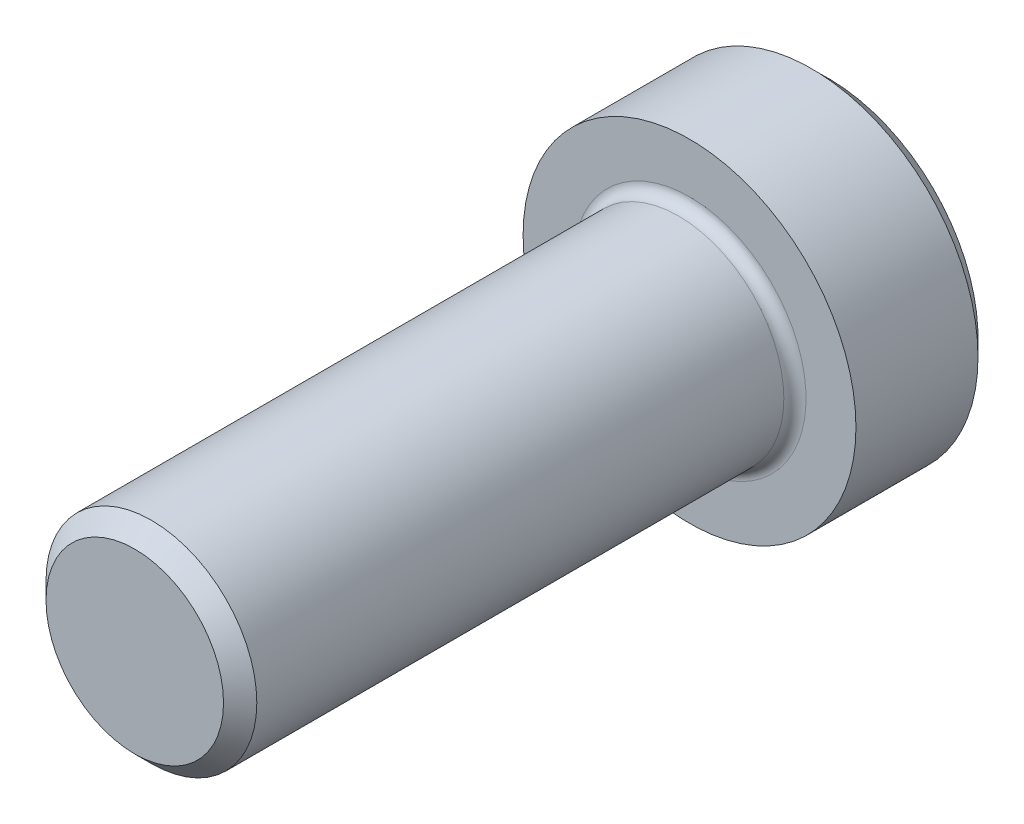
ISO-10303-21;
HEADER;
FILE_DESCRIPTION(('STEP AP214'),'2;1');
FILE_NAME('part.step','',(''),(''),'','','');
FILE_SCHEMA(('AUTOMOTIVE_DESIGN { 1 0 10303 214 1 1 1 1 }'));
ENDSEC;
DATA;
#1=APPLICATION_CONTEXT('core data for automotive mechanical design processes');
#2=APPLICATION_PROTOCOL_DEFINITION('international standard','automotive_design',2000,#1);
#3=PRODUCT_CONTEXT('',#1,'mechanical');
#4=PRODUCT('Part','Part','',(#3));
#5=PRODUCT_RELATED_PRODUCT_CATEGORY('part','',(#4));
#6=PRODUCT_DEFINITION_FORMATION('','',#4);
#7=PRODUCT_DEFINITION_CONTEXT('part definition',#1,'design');
#8=PRODUCT_DEFINITION('design','',#6,#7);
#9=PRODUCT_DEFINITION_SHAPE('','',#8);
#10=(LENGTH_UNIT() NAMED_UNIT(*) SI_UNIT(.MILLI.,.METRE.));
#11=(NAMED_UNIT(*) PLANE_ANGLE_UNIT() SI_UNIT($,.RADIAN.));
#12=(NAMED_UNIT(*) SI_UNIT($,.STERADIAN.) SOLID_ANGLE_UNIT());
#13=UNCERTAINTY_MEASURE_WITH_UNIT(LENGTH_MEASURE(1.E-05),#10,'distance_accuracy_value','');
#14=(GEOMETRIC_REPRESENTATION_CONTEXT(3) GLOBAL_UNCERTAINTY_ASSIGNED_CONTEXT((#13)) GLOBAL_UNIT_ASSIGNED_CONTEXT((#10,
#11,#12)) REPRESENTATION_CONTEXT('',''));
#15=CARTESIAN_POINT('',(0.,0.,0.));
#16=DIRECTION('',(0.,0.,1.));
#17=DIRECTION('',(1.,0.,0.));
#18=AXIS2_PLACEMENT_3D('',#15,#16,#17);
#19=CARTESIAN_POINT('',(0.,0.,-0.1));
#20=DIRECTION('',(0.,0.,-1.));
#21=DIRECTION('',(-1.,0.,0.));
#22=AXIS2_PLACEMENT_3D('',#19,#20,#21);
#23=PLANE('',#22);
#24=CARTESIAN_POINT('',(0.,0.,-0.1));
#25=DIRECTION('',(0.,0.,-1.));
#26=DIRECTION('',(-1.,0.,0.));
#27=AXIS2_PLACEMENT_3D('',#24,#25,#26);
#28=CIRCLE('',#27,0.175);
#29=CARTESIAN_POINT('',(-0.151554445662277,0.0875000000000001,-0.1));
#30=VERTEX_POINT('',#29);
#31=CARTESIAN_POINT('',(0.,0.175,-0.1));
#32=VERTEX_POINT('',#31);
#33=EDGE_CURVE('E57',#30,#32,#28,.T.);
#34=ORIENTED_EDGE('',*,*,#33,.F.);
#35=DIRECTION('',(0.5,0.866025403784439,0.));
#36=VECTOR('',#35,1.);
#37=CARTESIAN_POINT('',(-0.202072594216369,0.,-0.1));
#38=LINE('',#37,#36);
#39=CARTESIAN_POINT('',(-0.101036297108184,0.175,-0.1));
#40=VERTEX_POINT('',#39);
#41=EDGE_CURVE('E128',#30,#40,#38,.T.);
#42=ORIENTED_EDGE('',*,*,#41,.T.);
#43=DIRECTION('',(1.,0.,0.));
#44=VECTOR('',#43,1.);
#45=CARTESIAN_POINT('',(-0.101036297108184,0.175,-0.1));
#46=LINE('',#45,#44);
#47=EDGE_CURVE('E131',#40,#32,#46,.T.);
#48=ORIENTED_EDGE('',*,*,#47,.T.);
#49=EDGE_LOOP('',(#34,#42,#48));
#50=FACE_BOUND('',#49,.T.);
#51=ADVANCED_FACE('F45',(#50),#23,.T.);
#52=CARTESIAN_POINT('',(0.151554445662277,0.0875000000000001,-0.1));
#53=VERTEX_POINT('',#52);
#54=EDGE_CURVE('E11',#32,#53,#28,.T.);
#55=ORIENTED_EDGE('',*,*,#54,.F.);
#56=CARTESIAN_POINT('',(0.101036297108185,0.175,-0.1));
#57=VERTEX_POINT('',#56);
#58=EDGE_CURVE('E146',#32,#57,#46,.T.);
#59=ORIENTED_EDGE('',*,*,#58,.T.);
#60=DIRECTION('',(0.5,-0.866025403784439,0.));
#61=VECTOR('',#60,1.);
#62=CARTESIAN_POINT('',(0.101036297108185,0.175,-0.1));
#63=LINE('',#62,#61);
#64=EDGE_CURVE('E154',#57,#53,#63,.T.);
#65=ORIENTED_EDGE('',*,*,#64,.T.);
#66=EDGE_LOOP('',(#55,#59,#65));
#67=FACE_BOUND('',#66,.T.);
#68=ADVANCED_FACE('F250',(#67),#23,.T.);
#69=CARTESIAN_POINT('',(0.151554445662277,-0.0875000000000001,-0.1));
#70=VERTEX_POINT('',#69);
#71=EDGE_CURVE('E55',#53,#70,#28,.T.);
#72=ORIENTED_EDGE('',*,*,#71,.F.);
#73=CARTESIAN_POINT('',(0.202072594216369,0.,-0.1));
#74=VERTEX_POINT('',#73);
#75=EDGE_CURVE('E153',#53,#74,#63,.T.);
#76=ORIENTED_EDGE('',*,*,#75,.T.);
#77=DIRECTION('',(-0.5,-0.866025403784439,0.));
#78=VECTOR('',#77,1.);
#79=CARTESIAN_POINT('',(0.202072594216369,0.,-0.1));
#80=LINE('',#79,#78);
#81=EDGE_CURVE('E159',#74,#70,#80,.T.);
#82=ORIENTED_EDGE('',*,*,#81,.T.);
#83=EDGE_LOOP('',(#72,#76,#82));
#84=FACE_BOUND('',#83,.T.);
#85=ADVANCED_FACE('F255',(#84),#23,.T.);
#86=CARTESIAN_POINT('',(0.,-0.175,-0.1));
#87=VERTEX_POINT('',#86);
#88=EDGE_CURVE('E285',#70,#87,#28,.T.);
#89=ORIENTED_EDGE('',*,*,#88,.F.);
#90=CARTESIAN_POINT('',(0.101036297108185,-0.175,-0.1));
#91=VERTEX_POINT('',#90);
#92=EDGE_CURVE('E158',#70,#91,#80,.T.);
#93=ORIENTED_EDGE('',*,*,#92,.T.);
#94=DIRECTION('',(-1.,0.,0.));
#95=VECTOR('',#94,1.);
#96=CARTESIAN_POINT('',(0.101036297108185,-0.175,-0.1));
#97=LINE('',#96,#95);
#98=EDGE_CURVE('E164',#91,#87,#97,.T.);
#99=ORIENTED_EDGE('',*,*,#98,.T.);
#100=EDGE_LOOP('',(#89,#93,#99));
#101=FACE_BOUND('',#100,.T.);
#102=ADVANCED_FACE('F271',(#101),#23,.T.);
#103=CARTESIAN_POINT('',(-0.151554445662277,-0.0875,-0.1));
#104=VERTEX_POINT('',#103);
#105=EDGE_CURVE('E64',#87,#104,#28,.T.);
#106=ORIENTED_EDGE('',*,*,#105,.F.);
#107=CARTESIAN_POINT('',(-0.101036297108185,-0.175,-0.1));
#108=VERTEX_POINT('',#107);
#109=EDGE_CURVE('E163',#87,#108,#97,.T.);
#110=ORIENTED_EDGE('',*,*,#109,.T.);
#111=DIRECTION('',(-0.5,0.866025403784439,0.));
#112=VECTOR('',#111,1.);
#113=CARTESIAN_POINT('',(-0.101036297108185,-0.175,-0.1));
#114=LINE('',#113,#112);
#115=EDGE_CURVE('E141',#108,#104,#114,.T.);
#116=ORIENTED_EDGE('',*,*,#115,.T.);
#117=EDGE_LOOP('',(#106,#110,#116));
#118=FACE_BOUND('',#117,.T.);
#119=ADVANCED_FACE('F260',(#118),#23,.T.);
#120=CARTESIAN_POINT('',(0.,0.,1.));
#121=DIRECTION('',(0.,0.,-1.));
#122=DIRECTION('',(-1.,0.,0.));
#123=AXIS2_PLACEMENT_3D('',#120,#121,#122);
#124=CYLINDRICAL_SURFACE('',#123,0.19);
#125=CARTESIAN_POINT('',(0.,0.,0.0200000000000001));
#126=DIRECTION('',(0.,0.,-1.));
#127=DIRECTION('',(-1.,0.,0.));
#128=AXIS2_PLACEMENT_3D('',#125,#126,#127);
#129=CIRCLE('',#128,0.19);
#130=CARTESIAN_POINT('',(-0.19,0.,0.0200000000000001));
#131=VERTEX_POINT('',#130);
#132=EDGE_CURVE('E225',#131,#131,#129,.F.);
#133=ORIENTED_EDGE('',*,*,#132,.T.);
#134=EDGE_LOOP('',(#133));
#135=FACE_BOUND('',#134,.T.);
#136=CARTESIAN_POINT('',(0.,0.,0.97));
#137=DIRECTION('',(0.,0.,1.));
#138=DIRECTION('',(1.,0.,0.));
#139=AXIS2_PLACEMENT_3D('',#136,#137,#138);
#140=CIRCLE('',#139,0.19);
#141=CARTESIAN_POINT('',(0.19,0.,0.97));
#142=VERTEX_POINT('',#141);
#143=EDGE_CURVE('E222',#142,#142,#140,.F.);
#144=ORIENTED_EDGE('',*,*,#143,.T.);
#145=EDGE_LOOP('',(#144));
#146=FACE_BOUND('',#145,.T.);
#147=ADVANCED_FACE('F270',(#135,#146),#124,.T.);
#148=CARTESIAN_POINT('',(0.,0.,1.));
#149=DIRECTION('',(0.,0.,1.));
#150=DIRECTION('',(1.,0.,0.));
#151=AXIS2_PLACEMENT_3D('',#148,#149,#150);
#152=PLANE('',#151);
#153=CARTESIAN_POINT('',(0.,0.,1.));
#154=DIRECTION('',(0.,0.,1.));
#155=DIRECTION('',(1.,0.,0.));
#156=AXIS2_PLACEMENT_3D('',#153,#154,#155);
#157=CIRCLE('',#156,0.16);
#158=CARTESIAN_POINT('',(0.16,0.,1.));
#159=VERTEX_POINT('',#158);
#160=EDGE_CURVE('E218',#159,#159,#157,.T.);
#161=ORIENTED_EDGE('',*,*,#160,.T.);
#162=EDGE_LOOP('',(#161));
#163=FACE_BOUND('',#162,.T.);
#164=ADVANCED_FACE('F277',(#163),#152,.T.);
#165=CARTESIAN_POINT('',(0.,0.,-0.25));
#166=DIRECTION('',(0.,0.,1.));
#167=DIRECTION('',(1.,0.,0.));
#168=AXIS2_PLACEMENT_3D('',#165,#166,#167);
#169=CYLINDRICAL_SURFACE('',#168,0.3);
#170=CARTESIAN_POINT('',(0.,0.,-0.22));
#171=DIRECTION('',(0.,0.,-1.));
#172=DIRECTION('',(-1.,0.,0.));
#173=AXIS2_PLACEMENT_3D('',#170,#171,#172);
#174=CIRCLE('',#173,0.3);
#175=CARTESIAN_POINT('',(-0.3,0.,-0.22));
#176=VERTEX_POINT('',#175);
#177=EDGE_CURVE('E214',#176,#176,#174,.F.);
#178=ORIENTED_EDGE('',*,*,#177,.T.);
#179=EDGE_LOOP('',(#178));
#180=FACE_BOUND('',#179,.T.);
#181=CARTESIAN_POINT('',(0.,0.,0.));
#182=DIRECTION('',(0.,0.,-1.));
#183=DIRECTION('',(-1.,0.,0.));
#184=AXIS2_PLACEMENT_3D('',#181,#182,#183);
#185=CIRCLE('',#184,0.3);
#186=CARTESIAN_POINT('',(-0.3,0.,0.));
#187=VERTEX_POINT('',#186);
#188=EDGE_CURVE('E193',#187,#187,#185,.T.);
#189=ORIENTED_EDGE('',*,*,#188,.T.);
#190=EDGE_LOOP('',(#189));
#191=FACE_BOUND('',#190,.T.);
#192=ADVANCED_FACE('F415',(#180,#191),#169,.T.);
#193=CARTESIAN_POINT('',(0.,0.,-0.25));
#194=DIRECTION('',(0.,0.,-1.));
#195=DIRECTION('',(-1.,0.,0.));
#196=AXIS2_PLACEMENT_3D('',#193,#194,#195);
#197=PLANE('',#196);
#198=DIRECTION('',(-0.5,0.866025403784439,0.));
#199=VECTOR('',#198,1.);
#200=CARTESIAN_POINT('',(-0.101036297108185,-0.175,-0.25));
#201=LINE('',#200,#199);
#202=CARTESIAN_POINT('',(-0.101036297108185,-0.175,-0.25));
#203=VERTEX_POINT('',#202);
#204=CARTESIAN_POINT('',(-0.202072594216369,0.,-0.25));
#205=VERTEX_POINT('',#204);
#206=EDGE_CURVE('E72',#203,#205,#201,.T.);
#207=ORIENTED_EDGE('',*,*,#206,.F.);
#208=DIRECTION('',(-1.,0.,0.));
#209=VECTOR('',#208,1.);
#210=CARTESIAN_POINT('',(0.101036297108185,-0.175,-0.25));
#211=LINE('',#210,#209);
#212=CARTESIAN_POINT('',(0.101036297108185,-0.175,-0.25));
#213=VERTEX_POINT('',#212);
#214=EDGE_CURVE('E186',#213,#203,#211,.T.);
#215=ORIENTED_EDGE('',*,*,#214,.F.);
#216=DIRECTION('',(-0.5,-0.866025403784439,0.));
#217=VECTOR('',#216,1.);
#218=CARTESIAN_POINT('',(0.202072594216369,0.,-0.25));
#219=LINE('',#218,#217);
#220=CARTESIAN_POINT('',(0.202072594216369,0.,-0.25));
#221=VERTEX_POINT('',#220);
#222=EDGE_CURVE('E182',#221,#213,#219,.T.);
#223=ORIENTED_EDGE('',*,*,#222,.F.);
#224=DIRECTION('',(0.5,-0.866025403784439,0.));
#225=VECTOR('',#224,1.);
#226=CARTESIAN_POINT('',(0.101036297108185,0.175,-0.25));
#227=LINE('',#226,#225);
#228=CARTESIAN_POINT('',(0.101036297108185,0.175,-0.25));
#229=VERTEX_POINT('',#228);
#230=EDGE_CURVE('E178',#229,#221,#227,.T.);
#231=ORIENTED_EDGE('',*,*,#230,.F.);
#232=DIRECTION('',(1.,0.,0.));
#233=VECTOR('',#232,1.);
#234=CARTESIAN_POINT('',(-0.101036297108184,0.175,-0.25));
#235=LINE('',#234,#233);
#236=CARTESIAN_POINT('',(-0.101036297108184,0.175,-0.25));
#237=VERTEX_POINT('',#236);
#238=EDGE_CURVE('E174',#237,#229,#235,.T.);
#239=ORIENTED_EDGE('',*,*,#238,.F.);
#240=DIRECTION('',(0.5,0.866025403784439,0.));
#241=VECTOR('',#240,1.);
#242=CARTESIAN_POINT('',(-0.202072594216369,0.,-0.25));
#243=LINE('',#242,#241);
#244=EDGE_CURVE('E171',#205,#237,#243,.T.);
#245=ORIENTED_EDGE('',*,*,#244,.F.);
#246=EDGE_LOOP('',(#207,#215,#223,#231,#239,#245));
#247=FACE_BOUND('',#246,.T.);
#248=CARTESIAN_POINT('',(0.,0.,-0.25));
#249=DIRECTION('',(0.,0.,-1.));
#250=DIRECTION('',(-1.,0.,0.));
#251=AXIS2_PLACEMENT_3D('',#248,#249,#250);
#252=CIRCLE('',#251,0.27);
#253=CARTESIAN_POINT('',(-0.27,0.,-0.25));
#254=VERTEX_POINT('',#253);
#255=EDGE_CURVE('E210',#254,#254,#252,.T.);
#256=ORIENTED_EDGE('',*,*,#255,.T.);
#257=EDGE_LOOP('',(#256));
#258=FACE_BOUND('',#257,.T.);
#259=ADVANCED_FACE('F300',(#247,#258),#197,.T.);
#260=CARTESIAN_POINT('',(0.,0.,0.));
#261=DIRECTION('',(0.,0.,-1.));
#262=DIRECTION('',(-1.,0.,0.));
#263=AXIS2_PLACEMENT_3D('',#260,#261,#262);
#264=PLANE('',#263);
#265=CARTESIAN_POINT('',(0.,0.,0.));
#266=DIRECTION('',(0.,0.,-1.));
#267=DIRECTION('',(-1.,0.,0.));
#268=AXIS2_PLACEMENT_3D('',#265,#266,#267);
#269=CIRCLE('',#268,0.21);
#270=CARTESIAN_POINT('',(-0.21,0.,0.));
#271=VERTEX_POINT('',#270);
#272=EDGE_CURVE('E49',#271,#271,#269,.T.);
#273=ORIENTED_EDGE('',*,*,#272,.T.);
#274=EDGE_LOOP('',(#273));
#275=FACE_BOUND('',#274,.T.);
#276=ORIENTED_EDGE('',*,*,#188,.F.);
#277=EDGE_LOOP('',(#276));
#278=FACE_BOUND('',#277,.T.);
#279=ADVANCED_FACE('F234',(#275,#278),#264,.F.);
#280=CARTESIAN_POINT('',(0.,0.,-0.25));
#281=DIRECTION('',(0.,0.,1.));
#282=DIRECTION('',(1.,0.,0.));
#283=AXIS2_PLACEMENT_3D('',#280,#281,#282);
#284=CONICAL_SURFACE('',#283,0.27,0.785398163397447);
#285=ORIENTED_EDGE('',*,*,#177,.F.);
#286=EDGE_LOOP('',(#285));
#287=FACE_BOUND('',#286,.T.);
#288=ORIENTED_EDGE('',*,*,#255,.F.);
#289=EDGE_LOOP('',(#288));
#290=FACE_BOUND('',#289,.T.);
#291=ADVANCED_FACE('F247',(#287,#290),#284,.T.);
#292=CARTESIAN_POINT('',(0.,0.,1.));
#293=DIRECTION('',(0.,0.,-1.));
#294=DIRECTION('',(-1.,0.,0.));
#295=AXIS2_PLACEMENT_3D('',#292,#293,#294);
#296=CONICAL_SURFACE('',#295,0.16,0.785398163397448);
#297=ORIENTED_EDGE('',*,*,#143,.F.);
#298=EDGE_LOOP('',(#297));
#299=FACE_BOUND('',#298,.T.);
#300=ORIENTED_EDGE('',*,*,#160,.F.);
#301=EDGE_LOOP('',(#300));
#302=FACE_BOUND('',#301,.T.);
#303=ADVANCED_FACE('F240',(#299,#302),#296,.T.);
#304=CARTESIAN_POINT('',(0.,0.,0.0200000000000001));
#305=DIRECTION('',(0.,0.,-1.));
#306=DIRECTION('',(-1.,0.,0.));
#307=AXIS2_PLACEMENT_3D('',#304,#305,#306);
#308=TOROIDAL_SURFACE('',#307,0.21,0.02);
#309=ORIENTED_EDGE('',*,*,#272,.F.);
#310=EDGE_LOOP('',(#309));
#311=FACE_BOUND('',#310,.T.);
#312=ORIENTED_EDGE('',*,*,#132,.F.);
#313=EDGE_LOOP('',(#312));
#314=FACE_BOUND('',#313,.T.);
#315=ADVANCED_FACE('F47',(#311,#314),#308,.F.);
#316=CARTESIAN_POINT('',(-0.101036297108185,-0.175,-0.1));
#317=DIRECTION('',(-0.866025403784439,-0.5,0.));
#318=DIRECTION('',(0.5,-0.866025403784439,0.));
#319=AXIS2_PLACEMENT_3D('',#316,#317,#318);
#320=PLANE('',#319);
#321=ORIENTED_EDGE('',*,*,#206,.T.);
#322=DIRECTION('',(0.,0.,-1.));
#323=VECTOR('',#322,1.);
#324=CARTESIAN_POINT('',(-0.202072594216369,0.,-0.1));
#325=LINE('',#324,#323);
#326=CARTESIAN_POINT('',(-0.202072594216369,0.,-0.1));
#327=VERTEX_POINT('',#326);
#328=EDGE_CURVE('E168',#327,#205,#325,.T.);
#329=ORIENTED_EDGE('',*,*,#328,.F.);
#330=EDGE_CURVE('E144',#104,#327,#114,.T.);
#331=ORIENTED_EDGE('',*,*,#330,.F.);
#332=ORIENTED_EDGE('',*,*,#115,.F.);
#333=DIRECTION('',(0.,0.,-1.));
#334=VECTOR('',#333,1.);
#335=CARTESIAN_POINT('',(-0.101036297108185,-0.175,-0.1));
#336=LINE('',#335,#334);
#337=EDGE_CURVE('E190',#108,#203,#336,.T.);
#338=ORIENTED_EDGE('',*,*,#337,.T.);
#339=EDGE_LOOP('',(#321,#329,#331,#332,#338));
#340=FACE_BOUND('',#339,.T.);
#341=ADVANCED_FACE('F239',(#340),#320,.F.);
#342=CARTESIAN_POINT('',(0.101036297108185,-0.175,-0.1));
#343=DIRECTION('',(0.,-1.,0.));
#344=DIRECTION('',(1.,0.,0.));
#345=AXIS2_PLACEMENT_3D('',#342,#343,#344);
#346=PLANE('',#345);
#347=ORIENTED_EDGE('',*,*,#214,.T.);
#348=ORIENTED_EDGE('',*,*,#337,.F.);
#349=ORIENTED_EDGE('',*,*,#109,.F.);
#350=ORIENTED_EDGE('',*,*,#98,.F.);
#351=DIRECTION('',(0.,0.,-1.));
#352=VECTOR('',#351,1.);
#353=CARTESIAN_POINT('',(0.101036297108185,-0.175,-0.1));
#354=LINE('',#353,#352);
#355=EDGE_CURVE('E194',#91,#213,#354,.T.);
#356=ORIENTED_EDGE('',*,*,#355,.T.);
#357=EDGE_LOOP('',(#347,#348,#349,#350,#356));
#358=FACE_BOUND('',#357,.T.);
#359=ADVANCED_FACE('F245',(#358),#346,.F.);
#360=CARTESIAN_POINT('',(0.202072594216369,0.,-0.1));
#361=DIRECTION('',(0.866025403784439,-0.5,0.));
#362=DIRECTION('',(0.5,0.866025403784439,0.));
#363=AXIS2_PLACEMENT_3D('',#360,#361,#362);
#364=PLANE('',#363);
#365=ORIENTED_EDGE('',*,*,#222,.T.);
#366=ORIENTED_EDGE('',*,*,#355,.F.);
#367=ORIENTED_EDGE('',*,*,#92,.F.);
#368=ORIENTED_EDGE('',*,*,#81,.F.);
#369=DIRECTION('',(0.,0.,-1.));
#370=VECTOR('',#369,1.);
#371=CARTESIAN_POINT('',(0.202072594216369,0.,-0.1));
#372=LINE('',#371,#370);
#373=EDGE_CURVE('E197',#74,#221,#372,.T.);
#374=ORIENTED_EDGE('',*,*,#373,.T.);
#375=EDGE_LOOP('',(#365,#366,#367,#368,#374));
#376=FACE_BOUND('',#375,.T.);
#377=ADVANCED_FACE('F295',(#376),#364,.F.);
#378=CARTESIAN_POINT('',(0.101036297108185,0.175,-0.1));
#379=DIRECTION('',(0.866025403784439,0.5,0.));
#380=DIRECTION('',(-0.5,0.866025403784439,0.));
#381=AXIS2_PLACEMENT_3D('',#378,#379,#380);
#382=PLANE('',#381);
#383=ORIENTED_EDGE('',*,*,#230,.T.);
#384=ORIENTED_EDGE('',*,*,#373,.F.);
#385=ORIENTED_EDGE('',*,*,#75,.F.);
#386=ORIENTED_EDGE('',*,*,#64,.F.);
#387=DIRECTION('',(0.,0.,-1.));
#388=VECTOR('',#387,1.);
#389=CARTESIAN_POINT('',(0.101036297108185,0.175,-0.1));
#390=LINE('',#389,#388);
#391=EDGE_CURVE('E200',#57,#229,#390,.T.);
#392=ORIENTED_EDGE('',*,*,#391,.T.);
#393=EDGE_LOOP('',(#383,#384,#385,#386,#392));
#394=FACE_BOUND('',#393,.T.);
#395=ADVANCED_FACE('F342',(#394),#382,.F.);
#396=CARTESIAN_POINT('',(-0.101036297108184,0.175,-0.1));
#397=DIRECTION('',(0.,1.,0.));
#398=DIRECTION('',(0.,0.,1.));
#399=AXIS2_PLACEMENT_3D('',#396,#397,#398);
#400=PLANE('',#399);
#401=ORIENTED_EDGE('',*,*,#238,.T.);
#402=ORIENTED_EDGE('',*,*,#391,.F.);
#403=ORIENTED_EDGE('',*,*,#58,.F.);
#404=ORIENTED_EDGE('',*,*,#47,.F.);
#405=DIRECTION('',(0.,0.,-1.));
#406=VECTOR('',#405,1.);
#407=CARTESIAN_POINT('',(-0.101036297108184,0.175,-0.1));
#408=LINE('',#407,#406);
#409=EDGE_CURVE('E139',#40,#237,#408,.T.);
#410=ORIENTED_EDGE('',*,*,#409,.T.);
#411=EDGE_LOOP('',(#401,#402,#403,#404,#410));
#412=FACE_BOUND('',#411,.T.);
#413=ADVANCED_FACE('F267',(#412),#400,.F.);
#414=CARTESIAN_POINT('',(-0.202072594216369,0.,-0.1));
#415=DIRECTION('',(-0.866025403784439,0.5,0.));
#416=DIRECTION('',(-0.5,-0.866025403784439,0.));
#417=AXIS2_PLACEMENT_3D('',#414,#415,#416);
#418=PLANE('',#417);
#419=ORIENTED_EDGE('',*,*,#244,.T.);
#420=ORIENTED_EDGE('',*,*,#409,.F.);
#421=ORIENTED_EDGE('',*,*,#41,.F.);
#422=EDGE_CURVE('E138',#327,#30,#38,.T.);
#423=ORIENTED_EDGE('',*,*,#422,.F.);
#424=ORIENTED_EDGE('',*,*,#328,.T.);
#425=EDGE_LOOP('',(#419,#420,#421,#423,#424));
#426=FACE_BOUND('',#425,.T.);
#427=ADVANCED_FACE('F137',(#426),#418,.F.);
#428=EDGE_CURVE('E117',#104,#30,#28,.T.);
#429=ORIENTED_EDGE('',*,*,#428,.F.);
#430=ORIENTED_EDGE('',*,*,#330,.T.);
#431=ORIENTED_EDGE('',*,*,#422,.T.);
#432=EDGE_LOOP('',(#429,#430,#431));
#433=FACE_BOUND('',#432,.T.);
#434=ADVANCED_FACE('F143',(#433),#23,.T.);
#435=CARTESIAN_POINT('',(0.,0.,-0.1));
#436=DIRECTION('',(0.,0.,-1.));
#437=DIRECTION('',(-1.,0.,0.));
#438=AXIS2_PLACEMENT_3D('',#435,#436,#437);
#439=CONICAL_SURFACE('',#438,0.175,1.0471975511966);
#440=CARTESIAN_POINT('',(0.,0.,0.));
#441=DIRECTION('',(0.,0.,-1.));
#442=DIRECTION('',(-1.,0.,0.));
#443=AXIS2_PLACEMENT_3D('',#440,#441,#442);
#444=CIRCLE('',#443,0.00179491924311155);
#445=CARTESIAN_POINT('',(-0.00179491924311155,0.,0.));
#446=VERTEX_POINT('',#445);
#447=EDGE_CURVE('E133',#446,#446,#444,.T.);
#448=ORIENTED_EDGE('',*,*,#447,.F.);
#449=EDGE_LOOP('',(#448));
#450=FACE_BOUND('',#449,.T.);
#451=ORIENTED_EDGE('',*,*,#33,.T.);
#452=ORIENTED_EDGE('',*,*,#54,.T.);
#453=ORIENTED_EDGE('',*,*,#71,.T.);
#454=ORIENTED_EDGE('',*,*,#88,.T.);
#455=ORIENTED_EDGE('',*,*,#105,.T.);
#456=ORIENTED_EDGE('',*,*,#428,.T.);
#457=EDGE_LOOP('',(#451,#452,#453,#454,#455,#456));
#458=FACE_BOUND('',#457,.T.);
#459=ADVANCED_FACE('F119',(#450,#458),#439,.F.);
#460=CARTESIAN_POINT('',(0.,0.,0.));
#461=DIRECTION('',(0.,0.,-1.));
#462=DIRECTION('',(-1.,0.,0.));
#463=AXIS2_PLACEMENT_3D('',#460,#461,#462);
#464=PLANE('',#463);
#465=ORIENTED_EDGE('',*,*,#447,.T.);
#466=EDGE_LOOP('',(#465));
#467=FACE_BOUND('',#466,.T.);
#468=ADVANCED_FACE('F265',(#467),#464,.T.);
#469=CLOSED_SHELL('',(#51,#68,#85,#102,#119,#147,#164,#192,#259,#279,#291,#303,#315,#341,#359,
#377,#395,#413,#427,#434,#459,#468));
#470=MANIFOLD_SOLID_BREP('B2',#469);
#471=ADVANCED_BREP_SHAPE_REPRESENTATION('',(#18,#470),#14);
#472=SHAPE_DEFINITION_REPRESENTATION(#9,#471);
ENDSEC;
END-ISO-10303-21;
